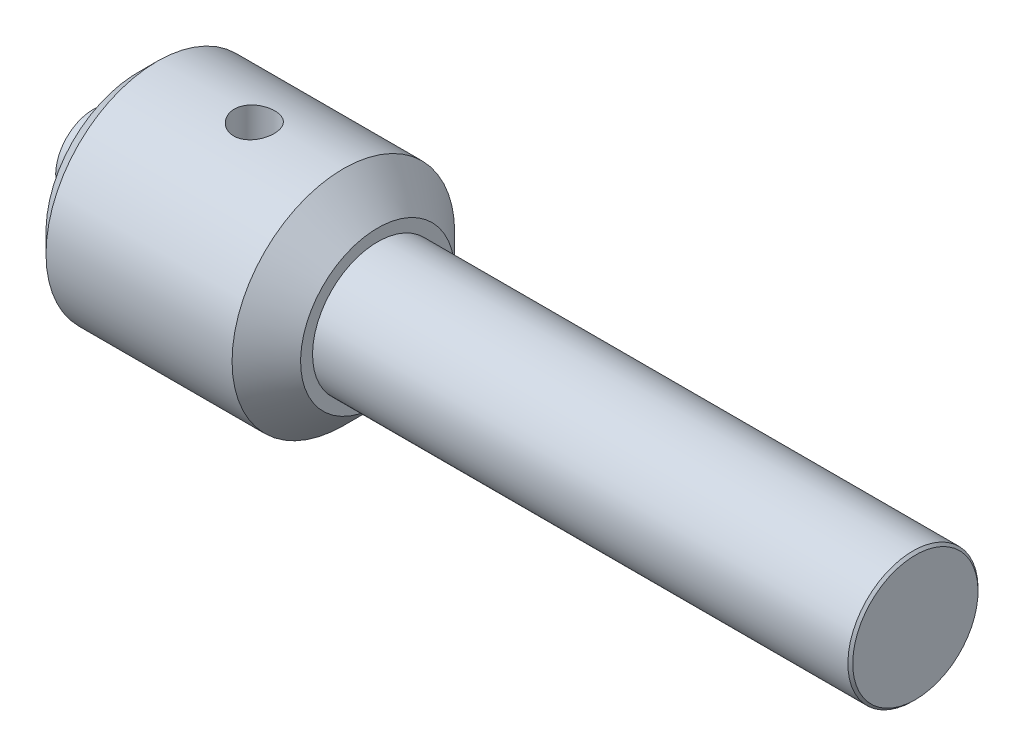
ISO-10303-21;
HEADER;
FILE_DESCRIPTION(('STEP AP214'),'2;1');
FILE_NAME('part.step','',(''),(''),'','','');
FILE_SCHEMA(('AUTOMOTIVE_DESIGN { 1 0 10303 214 1 1 1 1 }'));
ENDSEC;
DATA;
#1=APPLICATION_CONTEXT('core data for automotive mechanical design processes');
#2=APPLICATION_PROTOCOL_DEFINITION('international standard','automotive_design',2000,#1);
#3=PRODUCT_CONTEXT('',#1,'mechanical');
#4=PRODUCT('Part','Part','',(#3));
#5=PRODUCT_RELATED_PRODUCT_CATEGORY('part','',(#4));
#6=PRODUCT_DEFINITION_FORMATION('','',#4);
#7=PRODUCT_DEFINITION_CONTEXT('part definition',#1,'design');
#8=PRODUCT_DEFINITION('design','',#6,#7);
#9=PRODUCT_DEFINITION_SHAPE('','',#8);
#10=(LENGTH_UNIT() NAMED_UNIT(*) SI_UNIT(.MILLI.,.METRE.));
#11=(NAMED_UNIT(*) PLANE_ANGLE_UNIT() SI_UNIT($,.RADIAN.));
#12=(NAMED_UNIT(*) SI_UNIT($,.STERADIAN.) SOLID_ANGLE_UNIT());
#13=UNCERTAINTY_MEASURE_WITH_UNIT(LENGTH_MEASURE(1.E-05),#10,'distance_accuracy_value','');
#14=(GEOMETRIC_REPRESENTATION_CONTEXT(3) GLOBAL_UNCERTAINTY_ASSIGNED_CONTEXT((#13)) GLOBAL_UNIT_ASSIGNED_CONTEXT((#10,
#11,#12)) REPRESENTATION_CONTEXT('',''));
#15=CARTESIAN_POINT('',(0.,0.,0.));
#16=DIRECTION('',(0.,0.,1.));
#17=DIRECTION('',(1.,0.,0.));
#18=AXIS2_PLACEMENT_3D('',#15,#16,#17);
#19=CARTESIAN_POINT('',(70.4058664893532,0.,0.));
#20=DIRECTION('',(-1.,0.,0.));
#21=DIRECTION('',(0.,-1.,0.));
#22=AXIS2_PLACEMENT_3D('',#19,#20,#21);
#23=PLANE('',#22);
#24=CARTESIAN_POINT('',(70.4058664893532,0.,0.));
#25=DIRECTION('',(-1.,0.,0.));
#26=DIRECTION('',(0.,-1.,0.));
#27=AXIS2_PLACEMENT_3D('',#24,#25,#26);
#28=CIRCLE('',#27,18.2928932188135);
#29=CARTESIAN_POINT('',(70.4058664893532,-18.2928932188135,0.));
#30=VERTEX_POINT('',#29);
#31=EDGE_CURVE('E49',#30,#30,#28,.T.);
#32=ORIENTED_EDGE('',*,*,#31,.F.);
#33=EDGE_LOOP('',(#32));
#34=FACE_BOUND('',#33,.T.);
#35=ADVANCED_FACE('F35',(#34),#23,.F.);
#36=CARTESIAN_POINT('',(70.4058664893532,0.,0.));
#37=DIRECTION('',(-1.,0.,0.));
#38=DIRECTION('',(0.,-1.,0.));
#39=AXIS2_PLACEMENT_3D('',#36,#37,#38);
#40=CONICAL_SURFACE('',#39,18.2928932188135,0.785398163397429);
#41=CARTESIAN_POINT('',(69.6987597081666,0.,0.));
#42=DIRECTION('',(-1.,0.,0.));
#43=DIRECTION('',(0.,-1.,0.));
#44=AXIS2_PLACEMENT_3D('',#41,#42,#43);
#45=CIRCLE('',#44,19.);
#46=CARTESIAN_POINT('',(69.6987597081666,-19.,0.));
#47=VERTEX_POINT('',#46);
#48=EDGE_CURVE('E53',#47,#47,#45,.T.);
#49=ORIENTED_EDGE('',*,*,#48,.F.);
#50=EDGE_LOOP('',(#49));
#51=FACE_BOUND('',#50,.T.);
#52=ORIENTED_EDGE('',*,*,#31,.T.);
#53=EDGE_LOOP('',(#52));
#54=FACE_BOUND('',#53,.T.);
#55=ADVANCED_FACE('F93',(#51,#54),#40,.T.);
#56=CARTESIAN_POINT('',(-169.594133510647,0.,0.));
#57=DIRECTION('',(-1.,0.,0.));
#58=DIRECTION('',(0.,-1.,0.));
#59=AXIS2_PLACEMENT_3D('',#56,#57,#58);
#60=CYLINDRICAL_SURFACE('',#59,19.0000000000001);
#61=CARTESIAN_POINT('',(-86.5941335106468,0.,0.));
#62=DIRECTION('',(-1.,0.,0.));
#63=DIRECTION('',(0.,-1.,0.));
#64=AXIS2_PLACEMENT_3D('',#61,#62,#63);
#65=CIRCLE('',#64,19.0000000000001);
#66=CARTESIAN_POINT('',(-86.5941335106468,-19.0000000000001,0.));
#67=VERTEX_POINT('',#66);
#68=EDGE_CURVE('E123',#67,#67,#65,.T.);
#69=ORIENTED_EDGE('',*,*,#68,.F.);
#70=EDGE_LOOP('',(#69));
#71=FACE_BOUND('',#70,.T.);
#72=ORIENTED_EDGE('',*,*,#48,.T.);
#73=EDGE_LOOP('',(#72));
#74=FACE_BOUND('',#73,.T.);
#75=ADVANCED_FACE('F98',(#71,#74),#60,.T.);
#76=CARTESIAN_POINT('',(-86.5941335106468,19.0000000000001,0.));
#77=DIRECTION('',(-1.,0.,0.));
#78=DIRECTION('',(0.,-1.,0.));
#79=AXIS2_PLACEMENT_3D('',#76,#77,#78);
#80=PLANE('',#79);
#81=CARTESIAN_POINT('',(-86.5941335106468,0.,0.));
#82=DIRECTION('',(-1.,0.,0.));
#83=DIRECTION('',(0.,-1.,0.));
#84=AXIS2_PLACEMENT_3D('',#81,#82,#83);
#85=CIRCLE('',#84,22.5000000000001);
#86=CARTESIAN_POINT('',(-86.5941335106468,-22.5000000000001,0.));
#87=VERTEX_POINT('',#86);
#88=EDGE_CURVE('E122',#87,#87,#85,.T.);
#89=ORIENTED_EDGE('',*,*,#88,.F.);
#90=EDGE_LOOP('',(#89));
#91=FACE_BOUND('',#90,.T.);
#92=ORIENTED_EDGE('',*,*,#68,.T.);
#93=EDGE_LOOP('',(#92));
#94=FACE_BOUND('',#93,.T.);
#95=ADVANCED_FACE('F105',(#91,#94),#80,.F.);
#96=CARTESIAN_POINT('',(-86.5941335106468,0.,0.));
#97=DIRECTION('',(-1.,0.,0.));
#98=DIRECTION('',(0.,-1.,0.));
#99=AXIS2_PLACEMENT_3D('',#96,#97,#98);
#100=CONICAL_SURFACE('',#99,22.5000000000001,0.785398163397442);
#101=CARTESIAN_POINT('',(-96.5941335106468,0.,0.));
#102=DIRECTION('',(-1.,0.,0.));
#103=DIRECTION('',(0.,-1.,0.));
#104=AXIS2_PLACEMENT_3D('',#101,#102,#103);
#105=CIRCLE('',#104,32.4999999999999);
#106=CARTESIAN_POINT('',(-96.5941335106468,-32.4999999999999,0.));
#107=VERTEX_POINT('',#106);
#108=EDGE_CURVE('E119',#107,#107,#105,.T.);
#109=ORIENTED_EDGE('',*,*,#108,.F.);
#110=EDGE_LOOP('',(#109));
#111=FACE_BOUND('',#110,.T.);
#112=ORIENTED_EDGE('',*,*,#88,.T.);
#113=EDGE_LOOP('',(#112));
#114=FACE_BOUND('',#113,.T.);
#115=ADVANCED_FACE('F89',(#111,#114),#100,.T.);
#116=CARTESIAN_POINT('',(-169.594133510647,0.,0.));
#117=DIRECTION('',(-1.,0.,0.));
#118=DIRECTION('',(0.,-1.,0.));
#119=AXIS2_PLACEMENT_3D('',#116,#117,#118);
#120=CYLINDRICAL_SURFACE('',#119,32.5);
#121=CARTESIAN_POINT('',(-115.679571939133,-32.5,0.));
#122=CARTESIAN_POINT('',(-115.707736165819,-32.5000013202302,-0.165119830463803));
#123=CARTESIAN_POINT('',(-115.742816254417,-32.4987394583144,-0.329021732247282));
#124=CARTESIAN_POINT('',(-115.826561988284,-32.4938368649509,-0.653334036116702));
#125=CARTESIAN_POINT('',(-115.875230235314,-32.4901956777485,-0.8137437632));
#126=CARTESIAN_POINT('',(-115.985821856643,-32.4807362384987,-1.12996559423437));
#127=CARTESIAN_POINT('',(-116.047753427272,-32.4749166385881,-1.28577478713954));
#128=CARTESIAN_POINT('',(-116.184422416512,-32.4613629092937,-1.59165435766766));
#129=CARTESIAN_POINT('',(-116.259164550488,-32.4536280744746,-1.74172259716851));
#130=CARTESIAN_POINT('',(-116.420792004291,-32.4365690774109,-2.03482524609783));
#131=CARTESIAN_POINT('',(-116.507661827248,-32.4272469401481,-2.17786832188477));
#132=CARTESIAN_POINT('',(-116.693030310218,-32.4073539474495,-2.45619336869311));
#133=CARTESIAN_POINT('',(-116.79153324987,-32.3967826324602,-2.59147245609997));
#134=CARTESIAN_POINT('',(-116.999399547744,-32.3747794244321,-2.85322668295422));
#135=CARTESIAN_POINT('',(-117.108757524148,-32.3633479585209,-2.97970613278867));
#136=CARTESIAN_POINT('',(-117.337661571241,-32.3400128645633,-3.22312372172481));
#137=CARTESIAN_POINT('',(-117.457211416894,-32.3281090624488,-3.34005829383632));
#138=CARTESIAN_POINT('',(-117.706732796493,-32.3041339185079,-3.56451760034091));
#139=CARTESIAN_POINT('',(-117.836786174275,-32.2920620211563,-3.6719513110118));
#140=CARTESIAN_POINT('',(-118.105544313204,-32.2682612256747,-3.87554246315721));
#141=CARTESIAN_POINT('',(-118.244252266423,-32.2565324564718,-3.97169570593642));
#142=CARTESIAN_POINT('',(-118.529269243316,-32.2338234659701,-4.15197299274994));
#143=CARTESIAN_POINT('',(-118.675575662789,-32.2228429911553,-4.23610112150547));
#144=CARTESIAN_POINT('',(-118.974872323434,-32.2019924766689,-4.39179404184249));
#145=CARTESIAN_POINT('',(-119.127864997103,-32.1921228458768,-4.46335421280744));
#146=CARTESIAN_POINT('',(-119.439559037515,-32.173823081338,-4.59341148508734));
#147=CARTESIAN_POINT('',(-119.598265596487,-32.1653942990176,-4.65189633822087));
#148=CARTESIAN_POINT('',(-119.920181649429,-32.150269740619,-4.75530086094492));
#149=CARTESIAN_POINT('',(-120.083392793409,-32.1435746091487,-4.80021548587199));
#150=CARTESIAN_POINT('',(-120.413033005468,-32.1321527474179,-4.87608923302078));
#151=CARTESIAN_POINT('',(-120.579460639298,-32.1274251600856,-4.90705443216559));
#152=CARTESIAN_POINT('',(-120.914397548815,-32.1200893341349,-4.9548359183432));
#153=CARTESIAN_POINT('',(-121.082907563246,-32.1174818709176,-4.97164702882638));
#154=CARTESIAN_POINT('',(-121.586015759063,-32.1130369995429,-5.00035812782858));
#155=CARTESIAN_POINT('',(-121.922087470769,-32.1144389260237,-4.99142554436536));
#156=CARTESIAN_POINT('',(-122.587704440151,-32.1258067794857,-4.91770316101172));
#157=CARTESIAN_POINT('',(-122.917249800528,-32.1357725715954,-4.85291424079697));
#158=CARTESIAN_POINT('',(-123.559689759472,-32.1628938536302,-4.6697690152402));
#159=CARTESIAN_POINT('',(-123.872633639229,-32.1800265467537,-4.55158246488489));
#160=CARTESIAN_POINT('',(-124.474331929136,-32.2192441551056,-4.26510246581241));
#161=CARTESIAN_POINT('',(-124.763084648762,-32.241329416033,-4.09680551902282));
#162=CARTESIAN_POINT('',(-125.311297029941,-32.2877998622855,-3.71289843551452));
#163=CARTESIAN_POINT('',(-125.570439859353,-32.3122055740233,-3.49683824032209));
#164=CARTESIAN_POINT('',(-126.04899005842,-32.3598461298321,-3.02433714883374));
#165=CARTESIAN_POINT('',(-126.268395881984,-32.3830809283196,-2.76789468206734));
#166=CARTESIAN_POINT('',(-126.662398477007,-32.4252464309029,-2.22016162111868));
#167=CARTESIAN_POINT('',(-126.836746423599,-32.4441531711322,-1.92869001346236));
#168=CARTESIAN_POINT('',(-127.133952773447,-32.4746002400284,-1.32022605144745));
#169=CARTESIAN_POINT('',(-127.256815073363,-32.4861411262102,-1.00323563063047));
#170=CARTESIAN_POINT('',(-127.446412978325,-32.4996433402826,-0.356113084987361));
#171=CARTESIAN_POINT('',(-127.513693825491,-32.5016986584845,-0.0261427209205311));
#172=CARTESIAN_POINT('',(-127.592187441299,-32.495399919563,0.640289647008047));
#173=CARTESIAN_POINT('',(-127.603404259182,-32.48704661426,0.976751180280965));
#174=CARTESIAN_POINT('',(-127.56976137144,-32.4601399857584,1.64297466073299));
#175=CARTESIAN_POINT('',(-127.525472035943,-32.441691489483,1.97276993951504));
#176=CARTESIAN_POINT('',(-127.383300446128,-32.3958516265362,2.61994197087603));
#177=CARTESIAN_POINT('',(-127.285415829273,-32.3684598656576,2.93731817534807));
#178=CARTESIAN_POINT('',(-127.038133447777,-32.3066644529406,3.55331359361762));
#179=CARTESIAN_POINT('',(-126.888361597386,-32.2722106442115,3.85177744620462));
#180=CARTESIAN_POINT('',(-126.54174867708,-32.1993829859602,4.41947486745272));
#181=CARTESIAN_POINT('',(-126.344902149156,-32.1610086821774,4.68870504138856));
#182=CARTESIAN_POINT('',(-125.90570820343,-32.083126440917,5.19517702219693));
#183=CARTESIAN_POINT('',(-125.662641009172,-32.0436103359864,5.43179387673168));
#184=CARTESIAN_POINT('',(-125.139840106814,-31.9678973678121,5.86098618594573));
#185=CARTESIAN_POINT('',(-124.860105418243,-31.9317005933699,6.05356046256884));
#186=CARTESIAN_POINT('',(-124.2709532034,-31.8661958747064,6.38944588051232));
#187=CARTESIAN_POINT('',(-123.961477348599,-31.8369018730745,6.53265758198808));
#188=CARTESIAN_POINT('',(-123.322044960399,-31.7883884329894,6.76480208809987));
#189=CARTESIAN_POINT('',(-122.992091372974,-31.7691675491341,6.8537426804552));
#190=CARTESIAN_POINT('',(-122.327847622813,-31.7431400218929,6.97328836981785));
#191=CARTESIAN_POINT('',(-121.993759527314,-31.7361040598628,7.00497155309144));
#192=CARTESIAN_POINT('',(-121.324784200414,-31.7345098084837,7.01220273988988));
#193=CARTESIAN_POINT('',(-120.989897043093,-31.7399504041745,6.98775575945287));
#194=CARTESIAN_POINT('',(-120.497083396703,-31.7569034395905,6.91010858667735));
#195=CARTESIAN_POINT('',(-120.335440953625,-31.7639446106366,6.87774421259143));
#196=CARTESIAN_POINT('',(-120.015509081998,-31.7807055072453,6.79988136232608));
#197=CARTESIAN_POINT('',(-119.85721845298,-31.7904242557302,6.75438767689057));
#198=CARTESIAN_POINT('',(-119.545012653963,-31.8123005779405,6.65058878258706));
#199=CARTESIAN_POINT('',(-119.391099258189,-31.8244591249476,6.59227846003235));
#200=CARTESIAN_POINT('',(-119.088783675568,-31.8509006285999,6.46331651910467));
#201=CARTESIAN_POINT('',(-118.940379630723,-31.865182860759,6.39266910804847));
#202=CARTESIAN_POINT('',(-118.648354682122,-31.8956951573425,6.23865841751504));
#203=CARTESIAN_POINT('',(-118.504807338518,-31.9119455203911,6.15515970446357));
#204=CARTESIAN_POINT('',(-118.225289888567,-31.9458542773172,5.97667465811334));
#205=CARTESIAN_POINT('',(-118.089317196662,-31.9635121856729,5.88169228022219));
#206=CARTESIAN_POINT('',(-117.825722420754,-31.9998217212799,5.68082974490392));
#207=CARTESIAN_POINT('',(-117.698103996017,-32.0184737775757,5.57494486361066));
#208=CARTESIAN_POINT('',(-117.452151818675,-32.0563154542613,5.35306432839703));
#209=CARTESIAN_POINT('',(-117.333814863742,-32.0755048861152,5.237072191139));
#210=CARTESIAN_POINT('',(-117.104791079271,-32.1143808866999,4.99320496584892));
#211=CARTESIAN_POINT('',(-116.994313765247,-32.1340695129616,4.86513334756473));
#212=CARTESIAN_POINT('',(-116.784574873897,-32.1730736393067,4.60013683344691));
#213=CARTESIAN_POINT('',(-116.685309305737,-32.1923892701158,4.46321511527604));
#214=CARTESIAN_POINT('',(-116.49858725925,-32.230215218541,4.18132251852785));
#215=CARTESIAN_POINT('',(-116.411137543407,-32.2487250709188,4.03634709704263));
#216=CARTESIAN_POINT('',(-116.248774439297,-32.2844972237783,3.73946284594764));
#217=CARTESIAN_POINT('',(-116.173856286631,-32.3017599969649,3.58755667943648));
#218=CARTESIAN_POINT('',(-116.036865035033,-32.3347102562341,3.27733322527528));
#219=CARTESIAN_POINT('',(-115.97483171097,-32.3503927896708,3.1189978378352));
#220=CARTESIAN_POINT('',(-115.864401784652,-32.3797756522889,2.79752930903164));
#221=CARTESIAN_POINT('',(-115.816000039001,-32.3934767281514,2.63439800296621));
#222=CARTESIAN_POINT('',(-115.73322329022,-32.4186111726444,2.30455553307548));
#223=CARTESIAN_POINT('',(-115.698838736749,-32.4300460825443,2.13784688839137));
#224=CARTESIAN_POINT('',(-115.644345668086,-32.4504399637806,1.8020173710211));
#225=CARTESIAN_POINT('',(-115.62423415892,-32.4593994541307,1.63289701182351));
#226=CARTESIAN_POINT('',(-115.592843322468,-32.4780343332904,1.21931478785975));
#227=CARTESIAN_POINT('',(-115.589243062555,-32.4863173128462,0.974167136359907));
#228=CARTESIAN_POINT('',(-115.612030939708,-32.4972991190091,0.48514620822071));
#229=CARTESIAN_POINT('',(-115.638418404046,-32.4999980708811,0.241272903116726));
#230=CARTESIAN_POINT('',(-115.679571939133,-32.5,0.));
#231=B_SPLINE_CURVE_WITH_KNOTS('',3,(#121,#122,#123,#124,#125,#126,#127,#128,#129,#130,#131,
#132,#133,#134,#135,#136,#137,#138,#139,#140,#141,#142,#143,#144,#145,#146,#147,#148,#149,#150,
#151,#152,#153,#154,#155,#156,#157,#158,#159,#160,#161,#162,#163,#164,#165,#166,#167,#168,#169,
#170,#171,#172,#173,#174,#175,#176,#177,#178,#179,#180,#181,#182,#183,#184,#185,#186,#187,#188,
#189,#190,#191,#192,#193,#194,#195,#196,#197,#198,#199,#200,#201,#202,#203,#204,#205,#206,#207,
#208,#209,#210,#211,#212,#213,#214,#215,#216,#217,#218,#219,#220,#221,#222,#223,#224,#225,#226,
#227,#228,#229,#230),.UNSPECIFIED.,.T.,.F.,(4,2,2,2,2,2,2,2,2,2,2,2,2,2,2,2,2,2,2,2,2,2,2,2,2,2,
2,2,2,2,2,2,2,2,2,2,2,2,2,2,2,2,2,2,2,2,2,2,2,2,2,2,2,2,4),(0.,0.502297730002348,
1.00469170228061,1.50739703921426,2.01028781294232,2.51254177183529,3.01498108095425,
3.51717251827599,4.01955077705831,4.52631321498584,5.03326368017048,5.54004153181165,
6.04700531234564,6.55444201498605,7.06206712320074,7.56947087542547,8.07706011901062,
9.08039886627853,10.0837218123567,11.0838773232227,12.0841026686383,13.0941882394259,
14.1043131022459,15.1199024473165,16.1354149142274,17.1408429855171,18.1461984384004,
19.1413072478564,20.1364599263028,21.1389419239879,22.1415402094536,23.1612640781212,
24.1810152192966,25.2028087829054,26.2244556881163,27.2266574768677,28.2287697079483,
28.7233002401962,29.2176505512535,29.7121984614387,30.2065780441664,30.7065781544107,
31.2064065337661,31.7064523987812,32.2063249700719,32.7165628905759,33.2266186150665,
33.7369650307599,34.2471169736528,34.7588210649829,35.270331823377,35.7814934890372,
36.2925478995335,37.0265212202198,37.760478075712),.UNSPECIFIED.);
#232=CARTESIAN_POINT('',(-115.679571939133,-32.5,0.));
#233=VERTEX_POINT('',#232);
#234=EDGE_CURVE('E10',#233,#233,#231,.T.);
#235=ORIENTED_EDGE('',*,*,#234,.T.);
#236=EDGE_LOOP('',(#235));
#237=FACE_BOUND('',#236,.T.);
#238=CARTESIAN_POINT('',(-121.594133510647,31.7352288427794,7.00894073997066));
#239=CARTESIAN_POINT('',(-121.760467788222,31.7352272359763,7.00894376392837));
#240=CARTESIAN_POINT('',(-121.926763655814,31.7367590503446,7.00202184303667));
#241=CARTESIAN_POINT('',(-122.258201606195,31.7428419527212,6.97439602779375));
#242=CARTESIAN_POINT('',(-122.423343471331,31.7473935955408,6.95368960091239));
#243=CARTESIAN_POINT('',(-122.751323047286,31.7594005336273,6.89864231211793));
#244=CARTESIAN_POINT('',(-122.914159374752,31.7668575014786,6.86429359617023));
#245=CARTESIAN_POINT('',(-123.236340664544,31.7844804882656,6.7822238979266));
#246=CARTESIAN_POINT('',(-123.395684313718,31.7946475078222,6.7344979760852));
#247=CARTESIAN_POINT('',(-123.709471176849,31.8174073086724,6.62613382185329));
#248=CARTESIAN_POINT('',(-123.86392131877,31.8299964640661,6.56551487599221));
#249=CARTESIAN_POINT('',(-124.167173750926,31.8572936352752,6.43175713792686));
#250=CARTESIAN_POINT('',(-124.31597393316,31.8720024323031,6.35861372784317));
#251=CARTESIAN_POINT('',(-124.606807365334,31.9031598239884,6.20039416296485));
#252=CARTESIAN_POINT('',(-124.748843661094,31.9196076246084,6.11532344849833));
#253=CARTESIAN_POINT('',(-125.025343571445,31.9538517842652,5.9337920021711));
#254=CARTESIAN_POINT('',(-125.159804325242,31.9716486468834,5.83732700944872));
#255=CARTESIAN_POINT('',(-125.422051596092,32.0084141930078,5.63226587771181));
#256=CARTESIAN_POINT('',(-125.549718259494,32.0273957976934,5.5235187555691));
#257=CARTESIAN_POINT('',(-125.795512044086,32.0658487671119,5.29572341552089));
#258=CARTESIAN_POINT('',(-125.913635616913,32.0853203105193,5.17667139976636));
#259=CARTESIAN_POINT('',(-126.139474677607,32.1242790246306,4.92913649820461));
#260=CARTESIAN_POINT('',(-126.247193002669,32.1437661896052,4.80065620011124));
#261=CARTESIAN_POINT('',(-126.451569439663,32.1823147891315,4.53504441197359));
#262=CARTESIAN_POINT('',(-126.548223446694,32.201376063579,4.39790974020894));
#263=CARTESIAN_POINT('',(-126.7309068496,32.2388650102625,4.11416012540931));
#264=CARTESIAN_POINT('',(-126.816786541853,32.2572816312425,3.96744727726841));
#265=CARTESIAN_POINT('',(-126.97587688854,32.2928066914646,3.66708594607544));
#266=CARTESIAN_POINT('',(-127.049082781811,32.309914637736,3.51343488375846));
#267=CARTESIAN_POINT('',(-127.182206068844,32.3424237860547,3.20036704866495));
#268=CARTESIAN_POINT('',(-127.242129001771,32.3578256981947,3.04095271162741));
#269=CARTESIAN_POINT('',(-127.348271387223,32.3866027922034,2.71743070028654));
#270=CARTESIAN_POINT('',(-127.394485854037,32.399977235828,2.55332134215875));
#271=CARTESIAN_POINT('',(-127.51110708843,32.4363640045508,2.05913722541491));
#272=CARTESIAN_POINT('',(-127.560980557603,32.4560122394501,1.72369279488898));
#273=CARTESIAN_POINT('',(-127.60352722638,32.484826062566,1.04894504523699));
#274=CARTESIAN_POINT('',(-127.596206532658,32.4939927697852,0.709642141946371));
#275=CARTESIAN_POINT('',(-127.525106357763,32.5016572438338,0.0423612199335156));
#276=CARTESIAN_POINT('',(-127.462233633978,32.5003236493584,-0.285711147860187));
#277=CARTESIAN_POINT('',(-127.283066795111,32.4883675863575,-0.926729153609382));
#278=CARTESIAN_POINT('',(-127.166772360865,32.4777450623355,-1.23967470117825));
#279=CARTESIAN_POINT('',(-126.884115589966,32.4491714957228,-1.84180324475068));
#280=CARTESIAN_POINT('',(-126.717738033072,32.431218224729,-2.13097898306096));
#281=CARTESIAN_POINT('',(-126.339630496706,32.3906714109601,-2.67761999319388));
#282=CARTESIAN_POINT('',(-126.127896815556,32.3680774894508,-2.93508267409601));
#283=CARTESIAN_POINT('',(-125.661870439666,32.3210483195833,-3.41448539301426));
#284=CARTESIAN_POINT('',(-125.407063182562,32.2965930513173,-3.63592345129958));
#285=CARTESIAN_POINT('',(-124.863863341614,32.2494078473211,-4.03309004942708));
#286=CARTESIAN_POINT('',(-124.575469804366,32.2266779605991,-4.20881729123133));
#287=CARTESIAN_POINT('',(-123.971650549433,32.1858779594344,-4.51027907161982));
#288=CARTESIAN_POINT('',(-123.656107107765,32.1678296567653,-4.63578102931233));
#289=CARTESIAN_POINT('',(-123.00808829143,32.1389600390432,-4.83189023819745));
#290=CARTESIAN_POINT('',(-122.675614162211,32.1281381932245,-4.90250152103891));
#291=CARTESIAN_POINT('',(-122.006563425315,32.1152452567811,-4.98626394932995));
#292=CARTESIAN_POINT('',(-121.670056188883,32.1130916896427,-4.99995670159314));
#293=CARTESIAN_POINT('',(-120.999550903811,32.1175946003628,-4.97094790709358));
#294=CARTESIAN_POINT('',(-120.665552769864,32.124250777324,-4.92824828641575));
#295=CARTESIAN_POINT('',(-120.011594828487,32.1454217695193,-4.78819096747456));
#296=CARTESIAN_POINT('',(-119.691563036102,32.159889368137,-4.69116153980209));
#297=CARTESIAN_POINT('',(-119.072289561971,32.1947594190609,-4.44553258910108));
#298=CARTESIAN_POINT('',(-118.773049100131,32.215162219244,-4.29693004314552));
#299=CARTESIAN_POINT('',(-118.201160434485,32.2594278633047,-3.95093233739059));
#300=CARTESIAN_POINT('',(-117.928750037115,32.2833176708375,-3.75314761625724));
#301=CARTESIAN_POINT('',(-117.420757885519,32.3312542055959,-3.31488614630939));
#302=CARTESIAN_POINT('',(-117.185178224517,32.3553009416594,-3.0744069726724));
#303=CARTESIAN_POINT('',(-116.755652674926,32.4004470661892,-2.55525573722942));
#304=CARTESIAN_POINT('',(-116.562050895094,32.421521633214,-2.27629658124664));
#305=CARTESIAN_POINT('',(-116.224466072422,32.457388596521,-1.6894325397567));
#306=CARTESIAN_POINT('',(-116.08048020616,32.4721813502848,-1.38152930259953));
#307=CARTESIAN_POINT('',(-115.847266746743,32.4929267935605,-0.747961028623004));
#308=CARTESIAN_POINT('',(-115.757645701759,32.4989434548068,-0.422442648664684));
#309=CARTESIAN_POINT('',(-115.634219723341,32.5007982782372,0.23920863558497));
#310=CARTESIAN_POINT('',(-115.600410032324,32.4966373080785,0.575340632639333));
#311=CARTESIAN_POINT('',(-115.592214071076,32.4825593420623,1.07762389536902));
#312=CARTESIAN_POINT('',(-115.596428893569,32.476615178926,1.24381009618758));
#313=CARTESIAN_POINT('',(-115.618605768658,32.462229394647,1.57513749471291));
#314=CARTESIAN_POINT('',(-115.636562730225,32.4537886991014,1.74027905658665));
#315=CARTESIAN_POINT('',(-115.686082531464,32.4345294104874,2.06841795659503));
#316=CARTESIAN_POINT('',(-115.717650387188,32.4237099414855,2.23141448137055));
#317=CARTESIAN_POINT('',(-115.794118525618,32.3998933498098,2.55402764454461));
#318=CARTESIAN_POINT('',(-115.839014121343,32.3868969933831,2.71364545003534));
#319=CARTESIAN_POINT('',(-115.941993193045,32.3589226448241,3.02907514081816));
#320=CARTESIAN_POINT('',(-116.000126920356,32.3439371950146,3.18486995111437));
#321=CARTESIAN_POINT('',(-116.129025282091,32.3123387383395,3.49090584137014));
#322=CARTESIAN_POINT('',(-116.199785490516,32.295726302704,3.64114884521714));
#323=CARTESIAN_POINT('',(-116.353473038448,32.2612167058674,3.93520314138587));
#324=CARTESIAN_POINT('',(-116.436405489671,32.2433190065423,4.07901169830084));
#325=CARTESIAN_POINT('',(-116.613806088941,32.2066433335603,4.35913705363667));
#326=CARTESIAN_POINT('',(-116.708270240496,32.1878656662522,4.49545642393622));
#327=CARTESIAN_POINT('',(-116.90985306459,32.1495133576851,4.76206299404661));
#328=CARTESIAN_POINT('',(-117.017162704721,32.1299305437977,4.89220467549002));
#329=CARTESIAN_POINT('',(-117.24231092478,32.090749122704,5.14294869517686));
#330=CARTESIAN_POINT('',(-117.360145755718,32.0711505235658,5.26355440142998));
#331=CARTESIAN_POINT('',(-117.605658734841,32.0323881133264,5.49452787371329));
#332=CARTESIAN_POINT('',(-117.733342781501,32.0132245718026,5.60488941620342));
#333=CARTESIAN_POINT('',(-117.997585721115,31.9758201789501,5.81448674393016));
#334=CARTESIAN_POINT('',(-118.134141270887,31.9575789845949,5.9137266823108));
#335=CARTESIAN_POINT('',(-118.416292175555,31.9223367603275,6.10111268312468));
#336=CARTESIAN_POINT('',(-118.561946866028,31.9053458890558,6.18917136178686));
#337=CARTESIAN_POINT('',(-118.8603102743,31.8732001286835,6.35264142045496));
#338=CARTESIAN_POINT('',(-119.013016312569,31.8580445499699,6.42805755502964));
#339=CARTESIAN_POINT('',(-119.324358063632,31.8299721113646,6.56565375998806));
#340=CARTESIAN_POINT('',(-119.482989577009,31.8170537012473,6.62784300269968));
#341=CARTESIAN_POINT('',(-119.805083311652,31.7937929109061,6.73853995201614));
#342=CARTESIAN_POINT('',(-119.968544494745,31.7834499815063,6.78705057563895));
#343=CARTESIAN_POINT('',(-120.372077618628,31.7616934044981,6.88829759372001));
#344=CARTESIAN_POINT('',(-120.614171524906,31.751815888121,6.93347841335692));
#345=CARTESIAN_POINT('',(-121.102249528925,31.7385849071701,6.99379723457272));
#346=CARTESIAN_POINT('',(-121.348233492565,31.7352312181943,7.00893626950752));
#347=CARTESIAN_POINT('',(-121.594133510647,31.7352288427794,7.00894073997066));
#348=B_SPLINE_CURVE_WITH_KNOTS('',3,(#238,#239,#240,#241,#242,#243,#244,#245,#246,#247,#248,
#249,#250,#251,#252,#253,#254,#255,#256,#257,#258,#259,#260,#261,#262,#263,#264,#265,#266,#267,
#268,#269,#270,#271,#272,#273,#274,#275,#276,#277,#278,#279,#280,#281,#282,#283,#284,#285,#286,
#287,#288,#289,#290,#291,#292,#293,#294,#295,#296,#297,#298,#299,#300,#301,#302,#303,#304,#305,
#306,#307,#308,#309,#310,#311,#312,#313,#314,#315,#316,#317,#318,#319,#320,#321,#322,#323,#324,
#325,#326,#327,#328,#329,#330,#331,#332,#333,#334,#335,#336,#337,#338,#339,#340,#341,#342,#343,
#344,#345,#346,#347),.UNSPECIFIED.,.T.,.F.,(4,2,2,2,2,2,2,2,2,2,2,2,2,2,2,2,2,2,2,2,2,2,2,2,2,2,
2,2,2,2,2,2,2,2,2,2,2,2,2,2,2,2,2,2,2,2,2,2,2,2,2,2,2,2,4),(0.,0.498785848717481,
0.997663361143861,1.49682850081777,1.99617820104163,2.49478611824872,2.99357827397968,
3.49214365441883,3.99089606590688,4.49663387890955,5.00255888076744,5.50834554061266,
6.01431924506626,6.5266871470612,7.03924711445383,7.5515929339167,8.06412486350235,
9.07783536543749,10.0914376340434,11.0887946850057,12.0861576946955,13.0838241091191,
14.081571977761,15.0922119285463,16.1028805750739,17.1181766774692,18.1333982006353,
19.1389369792064,20.1444414144279,21.1439349683987,22.1434871169747,23.1512238189719,
24.1590177734839,25.1747843967571,26.1904932076674,27.1987605406882,28.2069419205208,
28.7054969242769,29.203867318463,29.7024215353918,30.2008006325479,30.7011040568731,
31.2012324515725,31.7015714786435,32.2017375950874,32.7105734597065,33.2192287983367,
33.7281911602861,34.2369628224474,34.7494935102975,35.2618310126631,35.7738120623458,
36.2856838473895,37.0230884888257,37.7604677651023),.UNSPECIFIED.);
#349=CARTESIAN_POINT('',(-121.594133510647,31.7352288427794,7.00894073997066));
#350=VERTEX_POINT('',#349);
#351=EDGE_CURVE('E45',#350,#350,#348,.T.);
#352=ORIENTED_EDGE('',*,*,#351,.T.);
#353=EDGE_LOOP('',(#352));
#354=FACE_BOUND('',#353,.T.);
#355=CARTESIAN_POINT('',(-150.92097865068,0.,0.));
#356=DIRECTION('',(-1.,0.,0.));
#357=DIRECTION('',(0.,-1.,0.));
#358=AXIS2_PLACEMENT_3D('',#355,#356,#357);
#359=CIRCLE('',#358,32.5);
#360=CARTESIAN_POINT('',(-150.92097865068,-32.5,0.));
#361=VERTEX_POINT('',#360);
#362=EDGE_CURVE('E127',#361,#361,#359,.T.);
#363=ORIENTED_EDGE('',*,*,#362,.F.);
#364=EDGE_LOOP('',(#363));
#365=FACE_BOUND('',#364,.T.);
#366=ORIENTED_EDGE('',*,*,#108,.T.);
#367=EDGE_LOOP('',(#366));
#368=FACE_BOUND('',#367,.T.);
#369=ADVANCED_FACE('F58',(#237,#354,#365,#368),#120,.T.);
#370=CARTESIAN_POINT('',(-150.92097865068,0.,0.));
#371=DIRECTION('',(1.,0.,0.));
#372=DIRECTION('',(0.,1.,0.));
#373=AXIS2_PLACEMENT_3D('',#370,#371,#372);
#374=CONICAL_SURFACE('',#373,32.5,0.785398163397453);
#375=CARTESIAN_POINT('',(-156.594133510647,0.,0.));
#376=DIRECTION('',(-1.,0.,0.));
#377=DIRECTION('',(0.,-1.,0.));
#378=AXIS2_PLACEMENT_3D('',#375,#376,#377);
#379=CIRCLE('',#378,26.8268451400329);
#380=CARTESIAN_POINT('',(-156.594133510647,-26.8268451400329,0.));
#381=VERTEX_POINT('',#380);
#382=EDGE_CURVE('E134',#381,#381,#379,.T.);
#383=ORIENTED_EDGE('',*,*,#382,.F.);
#384=EDGE_LOOP('',(#383));
#385=FACE_BOUND('',#384,.T.);
#386=ORIENTED_EDGE('',*,*,#362,.T.);
#387=EDGE_LOOP('',(#386));
#388=FACE_BOUND('',#387,.T.);
#389=ADVANCED_FACE('F81',(#385,#388),#374,.T.);
#390=CARTESIAN_POINT('',(-156.594133510647,26.8268451400329,0.));
#391=DIRECTION('',(1.,0.,0.));
#392=DIRECTION('',(0.,1.,0.));
#393=AXIS2_PLACEMENT_3D('',#390,#391,#392);
#394=PLANE('',#393);
#395=CARTESIAN_POINT('',(-156.594133510647,0.,0.));
#396=DIRECTION('',(-1.,0.,0.));
#397=DIRECTION('',(0.,-1.,0.));
#398=AXIS2_PLACEMENT_3D('',#395,#396,#397);
#399=CIRCLE('',#398,11.);
#400=CARTESIAN_POINT('',(-156.594133510647,-11.,0.));
#401=VERTEX_POINT('',#400);
#402=EDGE_CURVE('E137',#401,#401,#399,.T.);
#403=ORIENTED_EDGE('',*,*,#402,.F.);
#404=EDGE_LOOP('',(#403));
#405=FACE_BOUND('',#404,.T.);
#406=ORIENTED_EDGE('',*,*,#382,.T.);
#407=EDGE_LOOP('',(#406));
#408=FACE_BOUND('',#407,.T.);
#409=ADVANCED_FACE('F78',(#405,#408),#394,.F.);
#410=CARTESIAN_POINT('',(-169.594133510647,0.,0.));
#411=DIRECTION('',(-1.,0.,0.));
#412=DIRECTION('',(0.,-1.,0.));
#413=AXIS2_PLACEMENT_3D('',#410,#411,#412);
#414=CYLINDRICAL_SURFACE('',#413,11.);
#415=CARTESIAN_POINT('',(-169.594133510647,0.,0.));
#416=DIRECTION('',(-1.,0.,0.));
#417=DIRECTION('',(0.,-1.,0.));
#418=AXIS2_PLACEMENT_3D('',#415,#416,#417);
#419=CIRCLE('',#418,11.);
#420=CARTESIAN_POINT('',(-169.594133510647,-11.,0.));
#421=VERTEX_POINT('',#420);
#422=EDGE_CURVE('E140',#421,#421,#419,.T.);
#423=ORIENTED_EDGE('',*,*,#422,.F.);
#424=EDGE_LOOP('',(#423));
#425=FACE_BOUND('',#424,.T.);
#426=ORIENTED_EDGE('',*,*,#402,.T.);
#427=EDGE_LOOP('',(#426));
#428=FACE_BOUND('',#427,.T.);
#429=ADVANCED_FACE('F74',(#425,#428),#414,.T.);
#430=CARTESIAN_POINT('',(-169.594133510647,11.,0.));
#431=DIRECTION('',(1.,0.,0.));
#432=DIRECTION('',(0.,1.,0.));
#433=AXIS2_PLACEMENT_3D('',#430,#431,#432);
#434=PLANE('',#433);
#435=CARTESIAN_POINT('',(-169.594133510647,0.,0.));
#436=DIRECTION('',(-1.,0.,0.));
#437=DIRECTION('',(0.,-1.,0.));
#438=AXIS2_PLACEMENT_3D('',#435,#436,#437);
#439=CIRCLE('',#438,6.);
#440=CARTESIAN_POINT('',(-169.594133510647,-6.,0.));
#441=VERTEX_POINT('',#440);
#442=EDGE_CURVE('E144',#441,#441,#439,.T.);
#443=ORIENTED_EDGE('',*,*,#442,.F.);
#444=EDGE_LOOP('',(#443));
#445=FACE_BOUND('',#444,.T.);
#446=ORIENTED_EDGE('',*,*,#422,.T.);
#447=EDGE_LOOP('',(#446));
#448=FACE_BOUND('',#447,.T.);
#449=ADVANCED_FACE('F68',(#445,#448),#434,.F.);
#450=CARTESIAN_POINT('',(-121.594133510647,-32.5,1.00894073997066));
#451=DIRECTION('',(0.,1.,0.));
#452=DIRECTION('',(0.,0.,1.));
#453=AXIS2_PLACEMENT_3D('',#450,#451,#452);
#454=CYLINDRICAL_SURFACE('',#453,6.);
#455=ORIENTED_EDGE('',*,*,#351,.F.);
#456=EDGE_LOOP('',(#455));
#457=FACE_BOUND('',#456,.T.);
#458=ORIENTED_EDGE('',*,*,#234,.F.);
#459=EDGE_LOOP('',(#458));
#460=FACE_BOUND('',#459,.T.);
#461=ADVANCED_FACE('F62',(#457,#460),#454,.F.);
#462=CARTESIAN_POINT('',(-139.594133510647,0.,0.));
#463=DIRECTION('',(-1.,0.,0.));
#464=DIRECTION('',(0.,-1.,0.));
#465=AXIS2_PLACEMENT_3D('',#462,#463,#464);
#466=CYLINDRICAL_SURFACE('',#465,6.);
#467=CARTESIAN_POINT('',(-139.594133510647,0.,0.));
#468=DIRECTION('',(-1.,0.,0.));
#469=DIRECTION('',(0.,-1.,0.));
#470=AXIS2_PLACEMENT_3D('',#467,#468,#469);
#471=CIRCLE('',#470,6.);
#472=CARTESIAN_POINT('',(-139.594133510647,-6.,0.));
#473=VERTEX_POINT('',#472);
#474=EDGE_CURVE('E143',#473,#473,#471,.T.);
#475=ORIENTED_EDGE('',*,*,#474,.F.);
#476=EDGE_LOOP('',(#475));
#477=FACE_BOUND('',#476,.T.);
#478=ORIENTED_EDGE('',*,*,#442,.T.);
#479=EDGE_LOOP('',(#478));
#480=FACE_BOUND('',#479,.T.);
#481=ADVANCED_FACE('F67',(#477,#480),#466,.F.);
#482=CARTESIAN_POINT('',(-139.594133510647,0.,0.));
#483=DIRECTION('',(-1.,0.,0.));
#484=DIRECTION('',(0.,-1.,0.));
#485=AXIS2_PLACEMENT_3D('',#482,#483,#484);
#486=PLANE('',#485);
#487=CARTESIAN_POINT('',(-139.594133510647,0.,0.));
#488=DIRECTION('',(-1.,0.,0.));
#489=DIRECTION('',(0.,-1.,0.));
#490=AXIS2_PLACEMENT_3D('',#487,#488,#489);
#491=CIRCLE('',#490,5.5);
#492=CARTESIAN_POINT('',(-139.594133510647,-5.5,0.));
#493=VERTEX_POINT('',#492);
#494=EDGE_CURVE('E150',#493,#493,#491,.T.);
#495=ORIENTED_EDGE('',*,*,#494,.F.);
#496=EDGE_LOOP('',(#495));
#497=FACE_BOUND('',#496,.T.);
#498=ORIENTED_EDGE('',*,*,#474,.T.);
#499=EDGE_LOOP('',(#498));
#500=FACE_BOUND('',#499,.T.);
#501=ADVANCED_FACE('F161',(#497,#500),#486,.T.);
#502=CARTESIAN_POINT('',(-134.594133510647,0.,0.));
#503=DIRECTION('',(-1.,0.,0.));
#504=DIRECTION('',(0.,-1.,0.));
#505=AXIS2_PLACEMENT_3D('',#502,#503,#504);
#506=CYLINDRICAL_SURFACE('',#505,5.5);
#507=CARTESIAN_POINT('',(-134.594133510647,0.,0.));
#508=DIRECTION('',(-1.,0.,0.));
#509=DIRECTION('',(0.,-1.,0.));
#510=AXIS2_PLACEMENT_3D('',#507,#508,#509);
#511=CIRCLE('',#510,5.5);
#512=CARTESIAN_POINT('',(-134.594133510647,-5.5,0.));
#513=VERTEX_POINT('',#512);
#514=EDGE_CURVE('E147',#513,#513,#511,.T.);
#515=ORIENTED_EDGE('',*,*,#514,.F.);
#516=EDGE_LOOP('',(#515));
#517=FACE_BOUND('',#516,.T.);
#518=ORIENTED_EDGE('',*,*,#494,.T.);
#519=EDGE_LOOP('',(#518));
#520=FACE_BOUND('',#519,.T.);
#521=ADVANCED_FACE('F158',(#517,#520),#506,.F.);
#522=CARTESIAN_POINT('',(-134.594133510647,0.,0.));
#523=DIRECTION('',(-1.,0.,0.));
#524=DIRECTION('',(0.,-1.,0.));
#525=AXIS2_PLACEMENT_3D('',#522,#523,#524);
#526=PLANE('',#525);
#527=ORIENTED_EDGE('',*,*,#514,.T.);
#528=EDGE_LOOP('',(#527));
#529=FACE_BOUND('',#528,.T.);
#530=ADVANCED_FACE('F156',(#529),#526,.T.);
#531=CLOSED_SHELL('',(#35,#55,#75,#95,#115,#369,#389,#409,#429,#449,#461,#481,#501,#521,#530));
#532=MANIFOLD_SOLID_BREP('B2',#531);
#533=ADVANCED_BREP_SHAPE_REPRESENTATION('',(#18,#532),#14);
#534=SHAPE_DEFINITION_REPRESENTATION(#9,#533);
ENDSEC;
END-ISO-10303-21;
